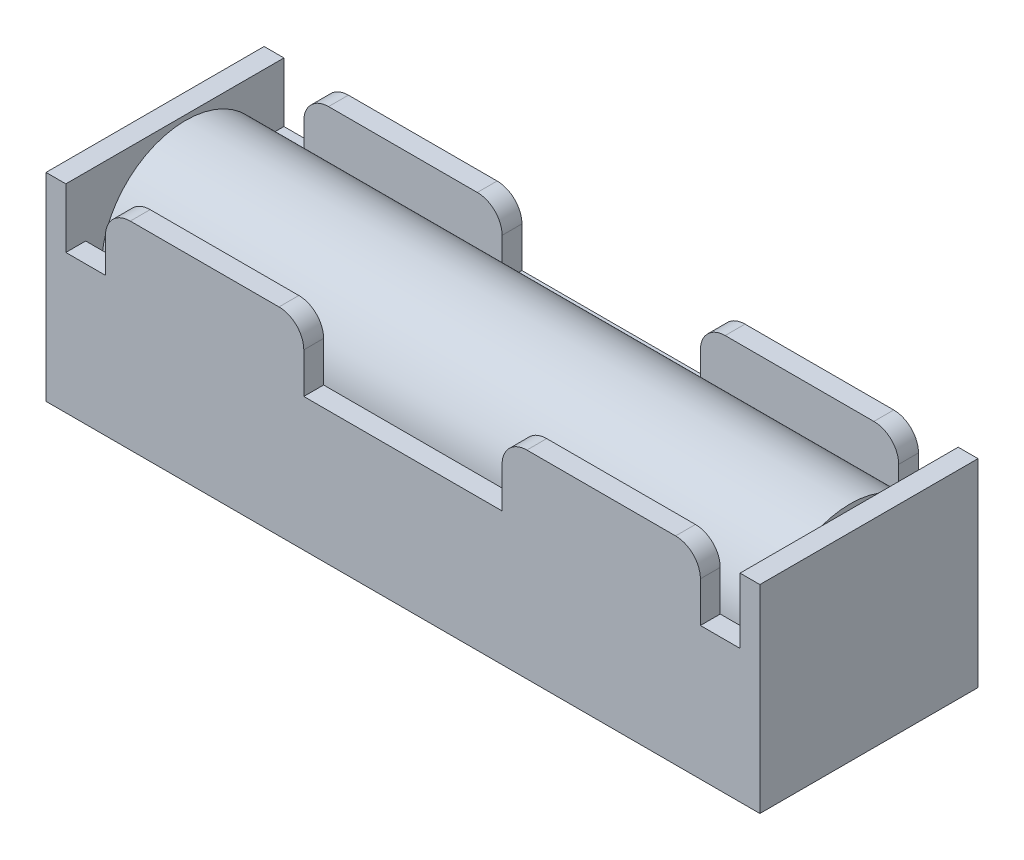
ISO-10303-21;
HEADER;
FILE_DESCRIPTION(('STEP AP214'),'2;1');
FILE_NAME('part.step','',(''),(''),'','','');
FILE_SCHEMA(('AUTOMOTIVE_DESIGN { 1 0 10303 214 1 1 1 1 }'));
ENDSEC;
DATA;
#1=APPLICATION_CONTEXT('core data for automotive mechanical design processes');
#2=APPLICATION_PROTOCOL_DEFINITION('international standard','automotive_design',2000,#1);
#3=PRODUCT_CONTEXT('',#1,'mechanical');
#4=PRODUCT('Part','Part','',(#3));
#5=PRODUCT_RELATED_PRODUCT_CATEGORY('part','',(#4));
#6=PRODUCT_DEFINITION_FORMATION('','',#4);
#7=PRODUCT_DEFINITION_CONTEXT('part definition',#1,'design');
#8=PRODUCT_DEFINITION('design','',#6,#7);
#9=PRODUCT_DEFINITION_SHAPE('','',#8);
#10=(LENGTH_UNIT() NAMED_UNIT(*) SI_UNIT(.MILLI.,.METRE.));
#11=(NAMED_UNIT(*) PLANE_ANGLE_UNIT() SI_UNIT($,.RADIAN.));
#12=(NAMED_UNIT(*) SI_UNIT($,.STERADIAN.) SOLID_ANGLE_UNIT());
#13=UNCERTAINTY_MEASURE_WITH_UNIT(LENGTH_MEASURE(1.E-05),#10,'distance_accuracy_value','');
#14=(GEOMETRIC_REPRESENTATION_CONTEXT(3) GLOBAL_UNCERTAINTY_ASSIGNED_CONTEXT((#13)) GLOBAL_UNIT_ASSIGNED_CONTEXT((#10,
#11,#12)) REPRESENTATION_CONTEXT('',''));
#15=CARTESIAN_POINT('',(0.,0.,0.));
#16=DIRECTION('',(0.,0.,1.));
#17=DIRECTION('',(1.,0.,0.));
#18=AXIS2_PLACEMENT_3D('',#15,#16,#17);
#19=CARTESIAN_POINT('',(21.6113360323887,2.,-21.7570850202429));
#20=DIRECTION('',(1.,0.,0.));
#21=DIRECTION('',(0.,0.,-1.));
#22=AXIS2_PLACEMENT_3D('',#19,#20,#21);
#23=PLANE('',#22);
#24=CARTESIAN_POINT('',(21.6113360323887,12.,-12.859898675805));
#25=DIRECTION('',(1.,0.,0.));
#26=DIRECTION('',(0.,0.,-1.));
#27=AXIS2_PLACEMENT_3D('',#24,#25,#26);
#28=CIRCLE('',#27,8.5);
#29=CARTESIAN_POINT('',(21.6113360323887,20.,-15.732179999074));
#30=VERTEX_POINT('',#29);
#31=CARTESIAN_POINT('',(21.6113360323887,20.,-9.98761735253599));
#32=VERTEX_POINT('',#31);
#33=EDGE_CURVE('E11',#30,#32,#28,.F.);
#34=ORIENTED_EDGE('',*,*,#33,.F.);
#35=DIRECTION('',(0.,0.,-1.));
#36=VECTOR('',#35,1.);
#37=CARTESIAN_POINT('',(21.6113360323887,20.,-21.7570850202429));
#38=LINE('',#37,#36);
#39=CARTESIAN_POINT('',(21.6113360323887,20.,-23.7570850202429));
#40=VERTEX_POINT('',#39);
#41=EDGE_CURVE('E278',#30,#40,#38,.T.);
#42=ORIENTED_EDGE('',*,*,#41,.T.);
#43=DIRECTION('',(0.,1.,0.));
#44=VECTOR('',#43,1.);
#45=CARTESIAN_POINT('',(21.6113360323887,20.,-23.7570850202429));
#46=LINE('',#45,#44);
#47=CARTESIAN_POINT('',(21.6113360323887,13.4242398730819,-23.7570850202429));
#48=VERTEX_POINT('',#47);
#49=EDGE_CURVE('E330',#48,#40,#46,.T.);
#50=ORIENTED_EDGE('',*,*,#49,.F.);
#51=DIRECTION('',(0.,0.,1.));
#52=VECTOR('',#51,1.);
#53=CARTESIAN_POINT('',(21.6113360323887,13.4242398730819,-31.7570850202429));
#54=LINE('',#53,#52);
#55=CARTESIAN_POINT('',(21.6113360323887,13.4242398730819,-21.7570850202429));
#56=VERTEX_POINT('',#55);
#57=EDGE_CURVE('E308',#48,#56,#54,.T.);
#58=ORIENTED_EDGE('',*,*,#57,.T.);
#59=DIRECTION('',(0.,1.,0.));
#60=VECTOR('',#59,1.);
#61=CARTESIAN_POINT('',(21.6113360323887,2.,-21.7570850202429));
#62=LINE('',#61,#60);
#63=CARTESIAN_POINT('',(21.6113360323887,2.,-21.7570850202429));
#64=VERTEX_POINT('',#63);
#65=EDGE_CURVE('E468',#64,#56,#62,.T.);
#66=ORIENTED_EDGE('',*,*,#65,.F.);
#67=DIRECTION('',(0.,0.,-1.));
#68=VECTOR('',#67,1.);
#69=CARTESIAN_POINT('',(21.6113360323887,2.,-21.7570850202429));
#70=LINE('',#69,#68);
#71=CARTESIAN_POINT('',(21.6113360323887,2.,-3.75708502024292));
#72=VERTEX_POINT('',#71);
#73=EDGE_CURVE('E451',#72,#64,#70,.T.);
#74=ORIENTED_EDGE('',*,*,#73,.F.);
#75=DIRECTION('',(0.,1.,0.));
#76=VECTOR('',#75,1.);
#77=CARTESIAN_POINT('',(21.6113360323887,2.,-3.75708502024292));
#78=LINE('',#77,#76);
#79=CARTESIAN_POINT('',(21.6113360323887,13.4242398730819,-3.75708502024292));
#80=VERTEX_POINT('',#79);
#81=EDGE_CURVE('E471',#72,#80,#78,.T.);
#82=ORIENTED_EDGE('',*,*,#81,.T.);
#83=CARTESIAN_POINT('',(21.6113360323887,13.4242398730819,-1.75708502024292));
#84=VERTEX_POINT('',#83);
#85=EDGE_CURVE('E309',#80,#84,#54,.T.);
#86=ORIENTED_EDGE('',*,*,#85,.T.);
#87=DIRECTION('',(0.,1.,0.));
#88=VECTOR('',#87,1.);
#89=CARTESIAN_POINT('',(21.6113360323887,0.,-1.75708502024292));
#90=LINE('',#89,#88);
#91=CARTESIAN_POINT('',(21.6113360323887,20.,-1.75708502024292));
#92=VERTEX_POINT('',#91);
#93=EDGE_CURVE('E272',#84,#92,#90,.T.);
#94=ORIENTED_EDGE('',*,*,#93,.T.);
#95=EDGE_CURVE('E269',#92,#32,#38,.T.);
#96=ORIENTED_EDGE('',*,*,#95,.T.);
#97=EDGE_LOOP('',(#34,#42,#50,#58,#66,#74,#82,#86,#94,#96));
#98=FACE_BOUND('',#97,.T.);
#99=ADVANCED_FACE('F34',(#98),#23,.F.);
#100=CARTESIAN_POINT('',(-48.3886639676113,20.,-1.75708502024292));
#101=DIRECTION('',(0.,0.,-1.));
#102=DIRECTION('',(-1.,0.,0.));
#103=AXIS2_PLACEMENT_3D('',#100,#101,#102);
#104=PLANE('',#103);
#105=CARTESIAN_POINT('',(15.1113360323887,17.4999999999999,-1.75708502024292));
#106=DIRECTION('',(0.,0.,1.));
#107=DIRECTION('',(1.,0.,0.));
#108=AXIS2_PLACEMENT_3D('',#105,#106,#107);
#109=CIRCLE('',#108,2.5);
#110=CARTESIAN_POINT('',(17.6113360323887,17.4999999999999,-1.75708502024292));
#111=VERTEX_POINT('',#110);
#112=CARTESIAN_POINT('',(15.1113360323887,20.,-1.75708502024292));
#113=VERTEX_POINT('',#112);
#114=EDGE_CURVE('E292',#111,#113,#109,.T.);
#115=ORIENTED_EDGE('',*,*,#114,.T.);
#116=DIRECTION('',(1.,0.,0.));
#117=VECTOR('',#116,1.);
#118=CARTESIAN_POINT('',(-48.3886639676113,20.,-1.75708502024292));
#119=LINE('',#118,#117);
#120=CARTESIAN_POINT('',(0.111336032388666,20.,-1.75708502024292));
#121=VERTEX_POINT('',#120);
#122=EDGE_CURVE('E546',#121,#113,#119,.T.);
#123=ORIENTED_EDGE('',*,*,#122,.F.);
#124=CARTESIAN_POINT('',(0.111336032388667,17.4999999999999,-1.75708502024292));
#125=DIRECTION('',(0.,0.,1.));
#126=DIRECTION('',(1.,0.,0.));
#127=AXIS2_PLACEMENT_3D('',#124,#125,#126);
#128=CIRCLE('',#127,2.5);
#129=CARTESIAN_POINT('',(-2.38866396761133,17.4999999999999,-1.75708502024292));
#130=VERTEX_POINT('',#129);
#131=EDGE_CURVE('E337',#121,#130,#128,.T.);
#132=ORIENTED_EDGE('',*,*,#131,.T.);
#133=DIRECTION('',(0.,1.,0.));
#134=VECTOR('',#133,1.);
#135=CARTESIAN_POINT('',(-2.38866396761133,0.,-1.75708502024292));
#136=LINE('',#135,#134);
#137=CARTESIAN_POINT('',(-2.38866396761133,13.4296487737832,-1.75708502024292));
#138=VERTEX_POINT('',#137);
#139=EDGE_CURVE('E349',#138,#130,#136,.T.);
#140=ORIENTED_EDGE('',*,*,#139,.F.);
#141=DIRECTION('',(1.,0.,0.));
#142=VECTOR('',#141,1.);
#143=CARTESIAN_POINT('',(0.,13.4296487737832,-1.75708502024292));
#144=LINE('',#143,#142);
#145=CARTESIAN_POINT('',(-22.3886639676113,13.4296487737832,-1.75708502024292));
#146=VERTEX_POINT('',#145);
#147=EDGE_CURVE('E346',#146,#138,#144,.T.);
#148=ORIENTED_EDGE('',*,*,#147,.F.);
#149=DIRECTION('',(0.,-1.,0.));
#150=VECTOR('',#149,1.);
#151=CARTESIAN_POINT('',(-22.3886639676113,0.,-1.75708502024292));
#152=LINE('',#151,#150);
#153=CARTESIAN_POINT('',(-22.3886639676113,17.5006897436102,-1.75708502024292));
#154=VERTEX_POINT('',#153);
#155=EDGE_CURVE('E343',#154,#146,#152,.T.);
#156=ORIENTED_EDGE('',*,*,#155,.F.);
#157=CARTESIAN_POINT('',(-24.8879742240011,17.5006897436102,-1.75708502024292));
#158=DIRECTION('',(0.,0.,1.));
#159=DIRECTION('',(1.,0.,0.));
#160=AXIS2_PLACEMENT_3D('',#157,#158,#159);
#161=CIRCLE('',#160,2.49931025638973);
#162=CARTESIAN_POINT('',(-24.8879742240011,20.,-1.75708502024292));
#163=VERTEX_POINT('',#162);
#164=EDGE_CURVE('E340',#154,#163,#161,.T.);
#165=ORIENTED_EDGE('',*,*,#164,.T.);
#166=CARTESIAN_POINT('',(-39.8879742240011,20.,-1.75708502024292));
#167=VERTEX_POINT('',#166);
#168=EDGE_CURVE('E485',#167,#163,#119,.T.);
#169=ORIENTED_EDGE('',*,*,#168,.F.);
#170=CARTESIAN_POINT('',(-39.8879742240011,17.4999999999999,-1.75708502024292));
#171=DIRECTION('',(0.,0.,1.));
#172=DIRECTION('',(1.,0.,0.));
#173=AXIS2_PLACEMENT_3D('',#170,#171,#172);
#174=CIRCLE('',#173,2.5);
#175=CARTESIAN_POINT('',(-42.3879742240011,17.4999999999999,-1.75708502024292));
#176=VERTEX_POINT('',#175);
#177=EDGE_CURVE('E398',#167,#176,#174,.T.);
#178=ORIENTED_EDGE('',*,*,#177,.T.);
#179=DIRECTION('',(0.,1.,0.));
#180=VECTOR('',#179,1.);
#181=CARTESIAN_POINT('',(-42.3879742240011,0.,-1.75708502024292));
#182=LINE('',#181,#180);
#183=CARTESIAN_POINT('',(-42.3879742240011,14.0070265503716,-1.75708502024292));
#184=VERTEX_POINT('',#183);
#185=EDGE_CURVE('E407',#184,#176,#182,.T.);
#186=ORIENTED_EDGE('',*,*,#185,.F.);
#187=DIRECTION('',(1.,0.,0.));
#188=VECTOR('',#187,1.);
#189=CARTESIAN_POINT('',(0.,14.0070265503716,-1.75708502024292));
#190=LINE('',#189,#188);
#191=CARTESIAN_POINT('',(-46.3886639676113,14.0070265503716,-1.75708502024292));
#192=VERTEX_POINT('',#191);
#193=EDGE_CURVE('E404',#192,#184,#190,.T.);
#194=ORIENTED_EDGE('',*,*,#193,.F.);
#195=DIRECTION('',(0.,-1.,0.));
#196=VECTOR('',#195,1.);
#197=CARTESIAN_POINT('',(-46.3886639676113,0.,-1.75708502024292));
#198=LINE('',#197,#196);
#199=CARTESIAN_POINT('',(-46.3886639676113,20.,-1.75708502024292));
#200=VERTEX_POINT('',#199);
#201=EDGE_CURVE('E401',#200,#192,#198,.T.);
#202=ORIENTED_EDGE('',*,*,#201,.F.);
#203=CARTESIAN_POINT('',(-48.3886639676113,20.,-1.75708502024292));
#204=VERTEX_POINT('',#203);
#205=EDGE_CURVE('E481',#204,#200,#119,.T.);
#206=ORIENTED_EDGE('',*,*,#205,.F.);
#207=DIRECTION('',(0.,-1.,0.));
#208=VECTOR('',#207,1.);
#209=CARTESIAN_POINT('',(-48.3886639676113,20.,-1.75708502024292));
#210=LINE('',#209,#208);
#211=CARTESIAN_POINT('',(-48.3886639676113,0.,-1.75708502024292));
#212=VERTEX_POINT('',#211);
#213=EDGE_CURVE('E507',#204,#212,#210,.T.);
#214=ORIENTED_EDGE('',*,*,#213,.T.);
#215=DIRECTION('',(1.,0.,0.));
#216=VECTOR('',#215,1.);
#217=CARTESIAN_POINT('',(-48.3886639676113,0.,-1.75708502024292));
#218=LINE('',#217,#216);
#219=CARTESIAN_POINT('',(23.6113360323887,0.,-1.75708502024292));
#220=VERTEX_POINT('',#219);
#221=EDGE_CURVE('E494',#212,#220,#218,.T.);
#222=ORIENTED_EDGE('',*,*,#221,.T.);
#223=DIRECTION('',(0.,-1.,0.));
#224=VECTOR('',#223,1.);
#225=CARTESIAN_POINT('',(23.6113360323887,20.,-1.75708502024292));
#226=LINE('',#225,#224);
#227=CARTESIAN_POINT('',(23.6113360323887,20.,-1.75708502024292));
#228=VERTEX_POINT('',#227);
#229=EDGE_CURVE('E504',#228,#220,#226,.T.);
#230=ORIENTED_EDGE('',*,*,#229,.F.);
#231=EDGE_CURVE('E479',#92,#228,#119,.T.);
#232=ORIENTED_EDGE('',*,*,#231,.F.);
#233=ORIENTED_EDGE('',*,*,#93,.F.);
#234=DIRECTION('',(1.,0.,0.));
#235=VECTOR('',#234,1.);
#236=CARTESIAN_POINT('',(0.,13.4242398730819,-1.75708502024292));
#237=LINE('',#236,#235);
#238=CARTESIAN_POINT('',(17.6113360323887,13.4242398730819,-1.75708502024292));
#239=VERTEX_POINT('',#238);
#240=EDGE_CURVE('E300',#239,#84,#237,.T.);
#241=ORIENTED_EDGE('',*,*,#240,.F.);
#242=DIRECTION('',(0.,-1.,0.));
#243=VECTOR('',#242,1.);
#244=CARTESIAN_POINT('',(17.6113360323887,0.,-1.75708502024292));
#245=LINE('',#244,#243);
#246=EDGE_CURVE('E297',#111,#239,#245,.T.);
#247=ORIENTED_EDGE('',*,*,#246,.F.);
#248=EDGE_LOOP('',(#115,#123,#132,#140,#148,#156,#165,#169,#178,#186,#194,#202,#206,#214,#222,
#230,#232,#233,#241,#247));
#249=FACE_BOUND('',#248,.T.);
#250=ADVANCED_FACE('F558',(#249),#104,.F.);
#251=CARTESIAN_POINT('',(-48.3886639676113,20.,-23.7570850202429));
#252=DIRECTION('',(0.,0.,1.));
#253=DIRECTION('',(1.,0.,0.));
#254=AXIS2_PLACEMENT_3D('',#251,#252,#253);
#255=PLANE('',#254);
#256=CARTESIAN_POINT('',(15.1113360323887,17.4999999999999,-23.7570850202429));
#257=DIRECTION('',(0.,0.,1.));
#258=DIRECTION('',(1.,0.,0.));
#259=AXIS2_PLACEMENT_3D('',#256,#257,#258);
#260=CIRCLE('',#259,2.5);
#261=CARTESIAN_POINT('',(17.6113360323887,17.4999999999999,-23.7570850202429));
#262=VERTEX_POINT('',#261);
#263=CARTESIAN_POINT('',(15.1113360323887,20.,-23.7570850202429));
#264=VERTEX_POINT('',#263);
#265=EDGE_CURVE('E335',#262,#264,#260,.T.);
#266=ORIENTED_EDGE('',*,*,#265,.F.);
#267=DIRECTION('',(0.,-1.,0.));
#268=VECTOR('',#267,1.);
#269=CARTESIAN_POINT('',(17.6113360323887,20.,-23.7570850202429));
#270=LINE('',#269,#268);
#271=CARTESIAN_POINT('',(17.6113360323887,13.4242398730819,-23.7570850202429));
#272=VERTEX_POINT('',#271);
#273=EDGE_CURVE('E327',#262,#272,#270,.T.);
#274=ORIENTED_EDGE('',*,*,#273,.T.);
#275=DIRECTION('',(1.,0.,0.));
#276=VECTOR('',#275,1.);
#277=CARTESIAN_POINT('',(-48.3886639676113,13.4242398730819,-23.7570850202429));
#278=LINE('',#277,#276);
#279=EDGE_CURVE('E321',#272,#48,#278,.T.);
#280=ORIENTED_EDGE('',*,*,#279,.T.);
#281=ORIENTED_EDGE('',*,*,#49,.T.);
#282=DIRECTION('',(-1.,0.,0.));
#283=VECTOR('',#282,1.);
#284=CARTESIAN_POINT('',(-48.3886639676113,20.,-23.7570850202429));
#285=LINE('',#284,#283);
#286=CARTESIAN_POINT('',(23.6113360323887,20.,-23.7570850202429));
#287=VERTEX_POINT('',#286);
#288=EDGE_CURVE('E488',#287,#40,#285,.T.);
#289=ORIENTED_EDGE('',*,*,#288,.F.);
#290=DIRECTION('',(0.,-1.,0.));
#291=VECTOR('',#290,1.);
#292=CARTESIAN_POINT('',(23.6113360323887,20.,-23.7570850202429));
#293=LINE('',#292,#291);
#294=CARTESIAN_POINT('',(23.6113360323887,0.,-23.7570850202429));
#295=VERTEX_POINT('',#294);
#296=EDGE_CURVE('E501',#287,#295,#293,.T.);
#297=ORIENTED_EDGE('',*,*,#296,.T.);
#298=DIRECTION('',(-1.,0.,0.));
#299=VECTOR('',#298,1.);
#300=CARTESIAN_POINT('',(-48.3886639676113,0.,-23.7570850202429));
#301=LINE('',#300,#299);
#302=CARTESIAN_POINT('',(-48.3886639676113,0.,-23.7570850202429));
#303=VERTEX_POINT('',#302);
#304=EDGE_CURVE('E480',#295,#303,#301,.T.);
#305=ORIENTED_EDGE('',*,*,#304,.T.);
#306=DIRECTION('',(0.,-1.,0.));
#307=VECTOR('',#306,1.);
#308=CARTESIAN_POINT('',(-48.3886639676113,20.,-23.7570850202429));
#309=LINE('',#308,#307);
#310=CARTESIAN_POINT('',(-48.3886639676113,20.,-23.7570850202429));
#311=VERTEX_POINT('',#310);
#312=EDGE_CURVE('E490',#311,#303,#309,.T.);
#313=ORIENTED_EDGE('',*,*,#312,.F.);
#314=CARTESIAN_POINT('',(-46.3886639676113,20.,-23.7570850202429));
#315=VERTEX_POINT('',#314);
#316=EDGE_CURVE('E487',#315,#311,#285,.T.);
#317=ORIENTED_EDGE('',*,*,#316,.F.);
#318=DIRECTION('',(0.,-1.,0.));
#319=VECTOR('',#318,1.);
#320=CARTESIAN_POINT('',(-46.3886639676113,20.,-23.7570850202429));
#321=LINE('',#320,#319);
#322=CARTESIAN_POINT('',(-46.3886639676113,14.0070265503716,-23.7570850202429));
#323=VERTEX_POINT('',#322);
#324=EDGE_CURVE('E423',#315,#323,#321,.T.);
#325=ORIENTED_EDGE('',*,*,#324,.T.);
#326=DIRECTION('',(1.,0.,0.));
#327=VECTOR('',#326,1.);
#328=CARTESIAN_POINT('',(-48.3886639676113,14.0070265503716,-23.7570850202429));
#329=LINE('',#328,#327);
#330=CARTESIAN_POINT('',(-42.3879742240011,14.0070265503716,-23.7570850202429));
#331=VERTEX_POINT('',#330);
#332=EDGE_CURVE('E429',#323,#331,#329,.T.);
#333=ORIENTED_EDGE('',*,*,#332,.T.);
#334=DIRECTION('',(0.,1.,0.));
#335=VECTOR('',#334,1.);
#336=CARTESIAN_POINT('',(-42.3879742240011,20.,-23.7570850202429));
#337=LINE('',#336,#335);
#338=CARTESIAN_POINT('',(-42.3879742240011,17.4999999999999,-23.7570850202429));
#339=VERTEX_POINT('',#338);
#340=EDGE_CURVE('E435',#331,#339,#337,.T.);
#341=ORIENTED_EDGE('',*,*,#340,.T.);
#342=CARTESIAN_POINT('',(-39.8879742240011,17.4999999999999,-23.7570850202429));
#343=DIRECTION('',(0.,0.,1.));
#344=DIRECTION('',(1.,0.,0.));
#345=AXIS2_PLACEMENT_3D('',#342,#343,#344);
#346=CIRCLE('',#345,2.5);
#347=CARTESIAN_POINT('',(-39.8879742240011,20.,-23.7570850202429));
#348=VERTEX_POINT('',#347);
#349=EDGE_CURVE('E441',#348,#339,#346,.T.);
#350=ORIENTED_EDGE('',*,*,#349,.F.);
#351=CARTESIAN_POINT('',(-24.8879742240011,20.,-23.7570850202429));
#352=VERTEX_POINT('',#351);
#353=EDGE_CURVE('E652',#352,#348,#285,.T.);
#354=ORIENTED_EDGE('',*,*,#353,.F.);
#355=CARTESIAN_POINT('',(-24.8879742240011,17.5006897436102,-23.7570850202429));
#356=DIRECTION('',(0.,0.,1.));
#357=DIRECTION('',(1.,0.,0.));
#358=AXIS2_PLACEMENT_3D('',#355,#356,#357);
#359=CIRCLE('',#358,2.49931025638973);
#360=CARTESIAN_POINT('',(-22.3886639676113,17.5006897436102,-23.7570850202429));
#361=VERTEX_POINT('',#360);
#362=EDGE_CURVE('E373',#361,#352,#359,.T.);
#363=ORIENTED_EDGE('',*,*,#362,.F.);
#364=DIRECTION('',(0.,-1.,0.));
#365=VECTOR('',#364,1.);
#366=CARTESIAN_POINT('',(-22.3886639676113,20.,-23.7570850202429));
#367=LINE('',#366,#365);
#368=CARTESIAN_POINT('',(-22.3886639676113,13.4296487737832,-23.7570850202429));
#369=VERTEX_POINT('',#368);
#370=EDGE_CURVE('E378',#361,#369,#367,.T.);
#371=ORIENTED_EDGE('',*,*,#370,.T.);
#372=DIRECTION('',(1.,0.,0.));
#373=VECTOR('',#372,1.);
#374=CARTESIAN_POINT('',(-48.3886639676113,13.4296487737832,-23.7570850202429));
#375=LINE('',#374,#373);
#376=CARTESIAN_POINT('',(-2.38866396761133,13.4296487737832,-23.7570850202429));
#377=VERTEX_POINT('',#376);
#378=EDGE_CURVE('E384',#369,#377,#375,.T.);
#379=ORIENTED_EDGE('',*,*,#378,.T.);
#380=DIRECTION('',(0.,1.,0.));
#381=VECTOR('',#380,1.);
#382=CARTESIAN_POINT('',(-2.38866396761133,20.,-23.7570850202429));
#383=LINE('',#382,#381);
#384=CARTESIAN_POINT('',(-2.38866396761133,17.4999999999999,-23.7570850202429));
#385=VERTEX_POINT('',#384);
#386=EDGE_CURVE('E390',#377,#385,#383,.T.);
#387=ORIENTED_EDGE('',*,*,#386,.T.);
#388=CARTESIAN_POINT('',(0.111336032388667,17.4999999999999,-23.7570850202429));
#389=DIRECTION('',(0.,0.,1.));
#390=DIRECTION('',(1.,0.,0.));
#391=AXIS2_PLACEMENT_3D('',#388,#389,#390);
#392=CIRCLE('',#391,2.5);
#393=CARTESIAN_POINT('',(0.111336032388666,20.,-23.7570850202429));
#394=VERTEX_POINT('',#393);
#395=EDGE_CURVE('E396',#394,#385,#392,.T.);
#396=ORIENTED_EDGE('',*,*,#395,.F.);
#397=EDGE_CURVE('E491',#264,#394,#285,.T.);
#398=ORIENTED_EDGE('',*,*,#397,.F.);
#399=EDGE_LOOP('',(#266,#274,#280,#281,#289,#297,#305,#313,#317,#325,#333,#341,#350,#354,#363,
#371,#379,#387,#396,#398));
#400=FACE_BOUND('',#399,.T.);
#401=ADVANCED_FACE('F571',(#400),#255,.F.);
#402=CARTESIAN_POINT('',(0.,20.,0.));
#403=DIRECTION('',(0.,1.,0.));
#404=DIRECTION('',(0.,0.,1.));
#405=AXIS2_PLACEMENT_3D('',#402,#403,#404);
#406=PLANE('',#405);
#407=DIRECTION('',(0.,0.,1.));
#408=VECTOR('',#407,1.);
#409=CARTESIAN_POINT('',(15.1113360323887,20.,-31.7570850202429));
#410=LINE('',#409,#408);
#411=CARTESIAN_POINT('',(15.1113360323887,20.,-3.75708502024292));
#412=VERTEX_POINT('',#411);
#413=EDGE_CURVE('E305',#412,#113,#410,.T.);
#414=ORIENTED_EDGE('',*,*,#413,.F.);
#415=DIRECTION('',(1.,0.,0.));
#416=VECTOR('',#415,1.);
#417=CARTESIAN_POINT('',(-46.3886639676113,20.,-3.75708502024292));
#418=LINE('',#417,#416);
#419=CARTESIAN_POINT('',(0.111336032388666,20.,-3.75708502024292));
#420=VERTEX_POINT('',#419);
#421=EDGE_CURVE('E459',#420,#412,#418,.T.);
#422=ORIENTED_EDGE('',*,*,#421,.F.);
#423=DIRECTION('',(0.,0.,1.));
#424=VECTOR('',#423,1.);
#425=CARTESIAN_POINT('',(0.111336032388666,20.,-31.7570850202429));
#426=LINE('',#425,#424);
#427=EDGE_CURVE('E352',#420,#121,#426,.T.);
#428=ORIENTED_EDGE('',*,*,#427,.T.);
#429=ORIENTED_EDGE('',*,*,#122,.T.);
#430=EDGE_LOOP('',(#414,#422,#428,#429));
#431=FACE_BOUND('',#430,.T.);
#432=ADVANCED_FACE('F544',(#431),#406,.T.);
#433=CARTESIAN_POINT('',(15.1113360323887,20.,-21.7570850202429));
#434=VERTEX_POINT('',#433);
#435=EDGE_CURVE('E307',#264,#434,#410,.T.);
#436=ORIENTED_EDGE('',*,*,#435,.F.);
#437=ORIENTED_EDGE('',*,*,#397,.T.);
#438=CARTESIAN_POINT('',(0.111336032388666,20.,-21.7570850202429));
#439=VERTEX_POINT('',#438);
#440=EDGE_CURVE('E368',#394,#439,#426,.T.);
#441=ORIENTED_EDGE('',*,*,#440,.T.);
#442=DIRECTION('',(-1.,0.,0.));
#443=VECTOR('',#442,1.);
#444=CARTESIAN_POINT('',(-46.3886639676113,20.,-21.7570850202429));
#445=LINE('',#444,#443);
#446=EDGE_CURVE('E448',#434,#439,#445,.T.);
#447=ORIENTED_EDGE('',*,*,#446,.F.);
#448=EDGE_LOOP('',(#436,#437,#441,#447));
#449=FACE_BOUND('',#448,.T.);
#450=ADVANCED_FACE('F663',(#449),#406,.T.);
#451=CARTESIAN_POINT('',(-46.3886639676113,2.,-21.7570850202429));
#452=DIRECTION('',(0.,0.,-1.));
#453=DIRECTION('',(-1.,0.,0.));
#454=AXIS2_PLACEMENT_3D('',#451,#452,#453);
#455=PLANE('',#454);
#456=CARTESIAN_POINT('',(15.1113360323887,17.4999999999999,-21.7570850202429));
#457=DIRECTION('',(0.,0.,-1.));
#458=DIRECTION('',(-1.,0.,0.));
#459=AXIS2_PLACEMENT_3D('',#456,#457,#458);
#460=CIRCLE('',#459,2.5);
#461=CARTESIAN_POINT('',(17.6113360323887,17.4999999999999,-21.7570850202429));
#462=VERTEX_POINT('',#461);
#463=EDGE_CURVE('E333',#434,#462,#460,.T.);
#464=ORIENTED_EDGE('',*,*,#463,.F.);
#465=ORIENTED_EDGE('',*,*,#446,.T.);
#466=CARTESIAN_POINT('',(0.111336032388667,17.4999999999999,-21.7570850202429));
#467=DIRECTION('',(0.,0.,-1.));
#468=DIRECTION('',(-1.,0.,0.));
#469=AXIS2_PLACEMENT_3D('',#466,#467,#468);
#470=CIRCLE('',#469,2.5);
#471=CARTESIAN_POINT('',(-2.38866396761133,17.4999999999999,-21.7570850202429));
#472=VERTEX_POINT('',#471);
#473=EDGE_CURVE('E393',#472,#439,#470,.T.);
#474=ORIENTED_EDGE('',*,*,#473,.F.);
#475=DIRECTION('',(0.,-1.,0.));
#476=VECTOR('',#475,1.);
#477=CARTESIAN_POINT('',(-2.38866396761133,2.,-21.7570850202429));
#478=LINE('',#477,#476);
#479=CARTESIAN_POINT('',(-2.38866396761133,13.4296487737832,-21.7570850202429));
#480=VERTEX_POINT('',#479);
#481=EDGE_CURVE('E387',#472,#480,#478,.T.);
#482=ORIENTED_EDGE('',*,*,#481,.T.);
#483=DIRECTION('',(-1.,0.,0.));
#484=VECTOR('',#483,1.);
#485=CARTESIAN_POINT('',(-46.3886639676113,13.4296487737832,-21.7570850202429));
#486=LINE('',#485,#484);
#487=CARTESIAN_POINT('',(-22.3886639676113,13.4296487737832,-21.7570850202429));
#488=VERTEX_POINT('',#487);
#489=EDGE_CURVE('E381',#480,#488,#486,.T.);
#490=ORIENTED_EDGE('',*,*,#489,.T.);
#491=DIRECTION('',(0.,1.,0.));
#492=VECTOR('',#491,1.);
#493=CARTESIAN_POINT('',(-22.3886639676113,2.00000000000002,-21.7570850202429));
#494=LINE('',#493,#492);
#495=CARTESIAN_POINT('',(-22.3886639676113,17.5006897436102,-21.7570850202429));
#496=VERTEX_POINT('',#495);
#497=EDGE_CURVE('E375',#488,#496,#494,.T.);
#498=ORIENTED_EDGE('',*,*,#497,.T.);
#499=CARTESIAN_POINT('',(-24.8879742240011,17.5006897436102,-21.7570850202429));
#500=DIRECTION('',(0.,0.,-1.));
#501=DIRECTION('',(-1.,0.,0.));
#502=AXIS2_PLACEMENT_3D('',#499,#500,#501);
#503=CIRCLE('',#502,2.49931025638973);
#504=CARTESIAN_POINT('',(-24.8879742240011,20.,-21.7570850202429));
#505=VERTEX_POINT('',#504);
#506=EDGE_CURVE('E371',#505,#496,#503,.T.);
#507=ORIENTED_EDGE('',*,*,#506,.F.);
#508=CARTESIAN_POINT('',(-39.8879742240011,20.,-21.7570850202429));
#509=VERTEX_POINT('',#508);
#510=EDGE_CURVE('E275',#505,#509,#445,.T.);
#511=ORIENTED_EDGE('',*,*,#510,.T.);
#512=CARTESIAN_POINT('',(-39.8879742240011,17.4999999999999,-21.7570850202429));
#513=DIRECTION('',(0.,0.,-1.));
#514=DIRECTION('',(-1.,0.,0.));
#515=AXIS2_PLACEMENT_3D('',#512,#513,#514);
#516=CIRCLE('',#515,2.5);
#517=CARTESIAN_POINT('',(-42.3879742240011,17.4999999999999,-21.7570850202429));
#518=VERTEX_POINT('',#517);
#519=EDGE_CURVE('E438',#518,#509,#516,.T.);
#520=ORIENTED_EDGE('',*,*,#519,.F.);
#521=DIRECTION('',(0.,-1.,0.));
#522=VECTOR('',#521,1.);
#523=CARTESIAN_POINT('',(-42.3879742240011,2.,-21.7570850202429));
#524=LINE('',#523,#522);
#525=CARTESIAN_POINT('',(-42.3879742240011,14.0070265503716,-21.7570850202429));
#526=VERTEX_POINT('',#525);
#527=EDGE_CURVE('E432',#518,#526,#524,.T.);
#528=ORIENTED_EDGE('',*,*,#527,.T.);
#529=DIRECTION('',(-1.,0.,0.));
#530=VECTOR('',#529,1.);
#531=CARTESIAN_POINT('',(-46.3886639676113,14.0070265503716,-21.7570850202429));
#532=LINE('',#531,#530);
#533=CARTESIAN_POINT('',(-46.3886639676113,14.0070265503716,-21.7570850202429));
#534=VERTEX_POINT('',#533);
#535=EDGE_CURVE('E426',#526,#534,#532,.T.);
#536=ORIENTED_EDGE('',*,*,#535,.T.);
#537=DIRECTION('',(0.,1.,0.));
#538=VECTOR('',#537,1.);
#539=CARTESIAN_POINT('',(-46.3886639676113,2.,-21.7570850202429));
#540=LINE('',#539,#538);
#541=CARTESIAN_POINT('',(-46.3886639676113,2.,-21.7570850202429));
#542=VERTEX_POINT('',#541);
#543=EDGE_CURVE('E464',#542,#534,#540,.T.);
#544=ORIENTED_EDGE('',*,*,#543,.F.);
#545=DIRECTION('',(-1.,0.,0.));
#546=VECTOR('',#545,1.);
#547=CARTESIAN_POINT('',(-46.3886639676113,2.,-21.7570850202429));
#548=LINE('',#547,#546);
#549=EDGE_CURVE('E454',#64,#542,#548,.T.);
#550=ORIENTED_EDGE('',*,*,#549,.F.);
#551=ORIENTED_EDGE('',*,*,#65,.T.);
#552=DIRECTION('',(-1.,0.,0.));
#553=VECTOR('',#552,1.);
#554=CARTESIAN_POINT('',(-46.3886639676113,13.4242398730819,-21.7570850202429));
#555=LINE('',#554,#553);
#556=CARTESIAN_POINT('',(17.6113360323887,13.4242398730819,-21.7570850202429));
#557=VERTEX_POINT('',#556);
#558=EDGE_CURVE('E318',#56,#557,#555,.T.);
#559=ORIENTED_EDGE('',*,*,#558,.T.);
#560=DIRECTION('',(0.,1.,0.));
#561=VECTOR('',#560,1.);
#562=CARTESIAN_POINT('',(17.6113360323887,2.,-21.7570850202429));
#563=LINE('',#562,#561);
#564=EDGE_CURVE('E324',#557,#462,#563,.T.);
#565=ORIENTED_EDGE('',*,*,#564,.T.);
#566=EDGE_LOOP('',(#464,#465,#474,#482,#490,#498,#507,#511,#520,#528,#536,#544,#550,#551,#559,#565));
#567=FACE_BOUND('',#566,.T.);
#568=ADVANCED_FACE('F580',(#567),#455,.F.);
#569=CARTESIAN_POINT('',(-46.3886639676113,2.,-3.75708502024292));
#570=DIRECTION('',(0.,0.,1.));
#571=DIRECTION('',(1.,0.,0.));
#572=AXIS2_PLACEMENT_3D('',#569,#570,#571);
#573=PLANE('',#572);
#574=CARTESIAN_POINT('',(15.1113360323887,17.4999999999999,-3.75708502024292));
#575=DIRECTION('',(0.,0.,1.));
#576=DIRECTION('',(1.,0.,0.));
#577=AXIS2_PLACEMENT_3D('',#574,#575,#576);
#578=CIRCLE('',#577,2.5);
#579=CARTESIAN_POINT('',(17.6113360323887,17.4999999999999,-3.75708502024292));
#580=VERTEX_POINT('',#579);
#581=EDGE_CURVE('E42',#580,#412,#578,.T.);
#582=ORIENTED_EDGE('',*,*,#581,.F.);
#583=DIRECTION('',(0.,-1.,0.));
#584=VECTOR('',#583,1.);
#585=CARTESIAN_POINT('',(17.6113360323887,2.,-3.75708502024292));
#586=LINE('',#585,#584);
#587=CARTESIAN_POINT('',(17.6113360323887,13.4242398730819,-3.75708502024292));
#588=VERTEX_POINT('',#587);
#589=EDGE_CURVE('E531',#580,#588,#586,.T.);
#590=ORIENTED_EDGE('',*,*,#589,.T.);
#591=DIRECTION('',(1.,0.,0.));
#592=VECTOR('',#591,1.);
#593=CARTESIAN_POINT('',(-46.3886639676113,13.4242398730819,-3.75708502024292));
#594=LINE('',#593,#592);
#595=EDGE_CURVE('E315',#588,#80,#594,.T.);
#596=ORIENTED_EDGE('',*,*,#595,.T.);
#597=ORIENTED_EDGE('',*,*,#81,.F.);
#598=DIRECTION('',(1.,0.,0.));
#599=VECTOR('',#598,1.);
#600=CARTESIAN_POINT('',(-46.3886639676113,2.,-3.75708502024292));
#601=LINE('',#600,#599);
#602=CARTESIAN_POINT('',(-46.3886639676113,2.,-3.75708502024292));
#603=VERTEX_POINT('',#602);
#604=EDGE_CURVE('E447',#603,#72,#601,.T.);
#605=ORIENTED_EDGE('',*,*,#604,.F.);
#606=DIRECTION('',(0.,1.,0.));
#607=VECTOR('',#606,1.);
#608=CARTESIAN_POINT('',(-46.3886639676113,2.,-3.75708502024292));
#609=LINE('',#608,#607);
#610=CARTESIAN_POINT('',(-46.3886639676113,14.0070265503716,-3.75708502024292));
#611=VERTEX_POINT('',#610);
#612=EDGE_CURVE('E457',#603,#611,#609,.T.);
#613=ORIENTED_EDGE('',*,*,#612,.T.);
#614=DIRECTION('',(1.,0.,0.));
#615=VECTOR('',#614,1.);
#616=CARTESIAN_POINT('',(-46.3886639676113,14.0070265503716,-3.75708502024292));
#617=LINE('',#616,#615);
#618=CARTESIAN_POINT('',(-42.3879742240011,14.0070265503716,-3.75708502024292));
#619=VERTEX_POINT('',#618);
#620=EDGE_CURVE('E510',#611,#619,#617,.T.);
#621=ORIENTED_EDGE('',*,*,#620,.T.);
#622=DIRECTION('',(0.,1.,0.));
#623=VECTOR('',#622,1.);
#624=CARTESIAN_POINT('',(-42.3879742240011,2.,-3.75708502024292));
#625=LINE('',#624,#623);
#626=CARTESIAN_POINT('',(-42.3879742240011,17.4999999999999,-3.75708502024292));
#627=VERTEX_POINT('',#626);
#628=EDGE_CURVE('E513',#619,#627,#625,.T.);
#629=ORIENTED_EDGE('',*,*,#628,.T.);
#630=CARTESIAN_POINT('',(-39.8879742240011,17.4999999999999,-3.75708502024292));
#631=DIRECTION('',(0.,0.,1.));
#632=DIRECTION('',(1.,0.,0.));
#633=AXIS2_PLACEMENT_3D('',#630,#631,#632);
#634=CIRCLE('',#633,2.5);
#635=CARTESIAN_POINT('',(-39.8879742240011,20.,-3.75708502024292));
#636=VERTEX_POINT('',#635);
#637=EDGE_CURVE('E516',#636,#627,#634,.T.);
#638=ORIENTED_EDGE('',*,*,#637,.F.);
#639=CARTESIAN_POINT('',(-24.8879742240011,20.,-3.75708502024292));
#640=VERTEX_POINT('',#639);
#641=EDGE_CURVE('E460',#636,#640,#418,.T.);
#642=ORIENTED_EDGE('',*,*,#641,.T.);
#643=CARTESIAN_POINT('',(-24.8879742240011,17.5006897436102,-3.75708502024292));
#644=DIRECTION('',(0.,0.,1.));
#645=DIRECTION('',(1.,0.,0.));
#646=AXIS2_PLACEMENT_3D('',#643,#644,#645);
#647=CIRCLE('',#646,2.49931025638973);
#648=CARTESIAN_POINT('',(-22.3886639676113,17.5006897436102,-3.75708502024292));
#649=VERTEX_POINT('',#648);
#650=EDGE_CURVE('E518',#649,#640,#647,.T.);
#651=ORIENTED_EDGE('',*,*,#650,.F.);
#652=DIRECTION('',(0.,-1.,0.));
#653=VECTOR('',#652,1.);
#654=CARTESIAN_POINT('',(-22.3886639676113,2.00000000000002,-3.75708502024292));
#655=LINE('',#654,#653);
#656=CARTESIAN_POINT('',(-22.3886639676113,13.4296487737832,-3.75708502024292));
#657=VERTEX_POINT('',#656);
#658=EDGE_CURVE('E520',#649,#657,#655,.T.);
#659=ORIENTED_EDGE('',*,*,#658,.T.);
#660=DIRECTION('',(1.,0.,0.));
#661=VECTOR('',#660,1.);
#662=CARTESIAN_POINT('',(-46.3886639676113,13.4296487737832,-3.75708502024292));
#663=LINE('',#662,#661);
#664=CARTESIAN_POINT('',(-2.38866396761133,13.4296487737832,-3.75708502024292));
#665=VERTEX_POINT('',#664);
#666=EDGE_CURVE('E523',#657,#665,#663,.T.);
#667=ORIENTED_EDGE('',*,*,#666,.T.);
#668=DIRECTION('',(0.,1.,0.));
#669=VECTOR('',#668,1.);
#670=CARTESIAN_POINT('',(-2.38866396761133,2.,-3.75708502024292));
#671=LINE('',#670,#669);
#672=CARTESIAN_POINT('',(-2.38866396761133,17.4999999999999,-3.75708502024292));
#673=VERTEX_POINT('',#672);
#674=EDGE_CURVE('E526',#665,#673,#671,.T.);
#675=ORIENTED_EDGE('',*,*,#674,.T.);
#676=CARTESIAN_POINT('',(0.111336032388667,17.4999999999999,-3.75708502024292));
#677=DIRECTION('',(0.,0.,1.));
#678=DIRECTION('',(1.,0.,0.));
#679=AXIS2_PLACEMENT_3D('',#676,#677,#678);
#680=CIRCLE('',#679,2.5);
#681=EDGE_CURVE('E529',#420,#673,#680,.T.);
#682=ORIENTED_EDGE('',*,*,#681,.F.);
#683=ORIENTED_EDGE('',*,*,#421,.T.);
#684=EDGE_LOOP('',(#582,#590,#596,#597,#605,#613,#621,#629,#638,#642,#651,#659,#667,#675,#682,#683));
#685=FACE_BOUND('',#684,.T.);
#686=ADVANCED_FACE('F548',(#685),#573,.F.);
#687=ORIENTED_EDGE('',*,*,#95,.F.);
#688=ORIENTED_EDGE('',*,*,#231,.T.);
#689=DIRECTION('',(0.,0.,-1.));
#690=VECTOR('',#689,1.);
#691=CARTESIAN_POINT('',(23.6113360323887,20.,-23.7570850202429));
#692=LINE('',#691,#690);
#693=EDGE_CURVE('E484',#228,#287,#692,.T.);
#694=ORIENTED_EDGE('',*,*,#693,.T.);
#695=ORIENTED_EDGE('',*,*,#288,.T.);
#696=ORIENTED_EDGE('',*,*,#41,.F.);
#697=EDGE_CURVE('E276',#32,#30,#38,.T.);
#698=ORIENTED_EDGE('',*,*,#697,.F.);
#699=EDGE_LOOP('',(#687,#688,#694,#695,#696,#698));
#700=FACE_BOUND('',#699,.T.);
#701=ADVANCED_FACE('F280',(#700),#406,.T.);
#702=DIRECTION('',(0.,0.,1.));
#703=VECTOR('',#702,1.);
#704=CARTESIAN_POINT('',(-24.8879742240011,20.,-31.7570850202429));
#705=LINE('',#704,#703);
#706=EDGE_CURVE('E365',#352,#505,#705,.T.);
#707=ORIENTED_EDGE('',*,*,#706,.F.);
#708=ORIENTED_EDGE('',*,*,#353,.T.);
#709=DIRECTION('',(0.,0.,1.));
#710=VECTOR('',#709,1.);
#711=CARTESIAN_POINT('',(-39.8879742240011,20.,-31.7570850202429));
#712=LINE('',#711,#710);
#713=EDGE_CURVE('E420',#348,#509,#712,.T.);
#714=ORIENTED_EDGE('',*,*,#713,.T.);
#715=ORIENTED_EDGE('',*,*,#510,.F.);
#716=EDGE_LOOP('',(#707,#708,#714,#715));
#717=FACE_BOUND('',#716,.T.);
#718=ADVANCED_FACE('F642',(#717),#406,.T.);
#719=EDGE_CURVE('E366',#640,#163,#705,.T.);
#720=ORIENTED_EDGE('',*,*,#719,.F.);
#721=ORIENTED_EDGE('',*,*,#641,.F.);
#722=EDGE_CURVE('E410',#636,#167,#712,.T.);
#723=ORIENTED_EDGE('',*,*,#722,.T.);
#724=ORIENTED_EDGE('',*,*,#168,.T.);
#725=EDGE_LOOP('',(#720,#721,#723,#724));
#726=FACE_BOUND('',#725,.T.);
#727=ADVANCED_FACE('F628',(#726),#406,.T.);
#728=CARTESIAN_POINT('',(-48.3886639676113,20.,-23.7570850202429));
#729=DIRECTION('',(1.,0.,0.));
#730=DIRECTION('',(0.,0.,-1.));
#731=AXIS2_PLACEMENT_3D('',#728,#729,#730);
#732=PLANE('',#731);
#733=DIRECTION('',(0.,0.,1.));
#734=VECTOR('',#733,1.);
#735=CARTESIAN_POINT('',(-48.3886639676113,0.,-23.7570850202429));
#736=LINE('',#735,#734);
#737=EDGE_CURVE('E467',#303,#212,#736,.T.);
#738=ORIENTED_EDGE('',*,*,#737,.T.);
#739=ORIENTED_EDGE('',*,*,#213,.F.);
#740=DIRECTION('',(0.,0.,1.));
#741=VECTOR('',#740,1.);
#742=CARTESIAN_POINT('',(-48.3886639676113,20.,-23.7570850202429));
#743=LINE('',#742,#741);
#744=EDGE_CURVE('E476',#311,#204,#743,.T.);
#745=ORIENTED_EDGE('',*,*,#744,.F.);
#746=ORIENTED_EDGE('',*,*,#312,.T.);
#747=EDGE_LOOP('',(#738,#739,#745,#746));
#748=FACE_BOUND('',#747,.T.);
#749=ADVANCED_FACE('F36',(#748),#732,.F.);
#750=CARTESIAN_POINT('',(23.6113360323887,20.,-23.7570850202429));
#751=DIRECTION('',(-1.,0.,0.));
#752=DIRECTION('',(0.,0.,1.));
#753=AXIS2_PLACEMENT_3D('',#750,#751,#752);
#754=PLANE('',#753);
#755=DIRECTION('',(0.,0.,-1.));
#756=VECTOR('',#755,1.);
#757=CARTESIAN_POINT('',(23.6113360323887,0.,-23.7570850202429));
#758=LINE('',#757,#756);
#759=EDGE_CURVE('E496',#220,#295,#758,.T.);
#760=ORIENTED_EDGE('',*,*,#759,.T.);
#761=ORIENTED_EDGE('',*,*,#296,.F.);
#762=ORIENTED_EDGE('',*,*,#693,.F.);
#763=ORIENTED_EDGE('',*,*,#229,.T.);
#764=EDGE_LOOP('',(#760,#761,#762,#763));
#765=FACE_BOUND('',#764,.T.);
#766=ADVANCED_FACE('F566',(#765),#754,.F.);
#767=DIRECTION('',(0.,0.,1.));
#768=VECTOR('',#767,1.);
#769=CARTESIAN_POINT('',(-46.3886639676113,20.,-21.7570850202429));
#770=LINE('',#769,#768);
#771=EDGE_CURVE('E443',#315,#200,#770,.T.);
#772=ORIENTED_EDGE('',*,*,#771,.F.);
#773=ORIENTED_EDGE('',*,*,#316,.T.);
#774=ORIENTED_EDGE('',*,*,#744,.T.);
#775=ORIENTED_EDGE('',*,*,#205,.T.);
#776=EDGE_LOOP('',(#772,#773,#774,#775));
#777=FACE_BOUND('',#776,.T.);
#778=ADVANCED_FACE('F624',(#777),#406,.T.);
#779=CARTESIAN_POINT('',(0.,0.,0.));
#780=DIRECTION('',(0.,1.,0.));
#781=DIRECTION('',(0.,0.,1.));
#782=AXIS2_PLACEMENT_3D('',#779,#780,#781);
#783=PLANE('',#782);
#784=ORIENTED_EDGE('',*,*,#737,.F.);
#785=ORIENTED_EDGE('',*,*,#304,.F.);
#786=ORIENTED_EDGE('',*,*,#759,.F.);
#787=ORIENTED_EDGE('',*,*,#221,.F.);
#788=EDGE_LOOP('',(#784,#785,#786,#787));
#789=FACE_BOUND('',#788,.T.);
#790=ADVANCED_FACE('F622',(#789),#783,.F.);
#791=CARTESIAN_POINT('',(-46.3886639676113,2.,-21.7570850202429));
#792=DIRECTION('',(-1.,0.,0.));
#793=DIRECTION('',(0.,0.,1.));
#794=AXIS2_PLACEMENT_3D('',#791,#792,#793);
#795=PLANE('',#794);
#796=ORIENTED_EDGE('',*,*,#543,.T.);
#797=DIRECTION('',(0.,0.,1.));
#798=VECTOR('',#797,1.);
#799=CARTESIAN_POINT('',(-46.3886639676113,14.0070265503716,-31.7570850202429));
#800=LINE('',#799,#798);
#801=EDGE_CURVE('E417',#323,#534,#800,.T.);
#802=ORIENTED_EDGE('',*,*,#801,.F.);
#803=ORIENTED_EDGE('',*,*,#324,.F.);
#804=ORIENTED_EDGE('',*,*,#771,.T.);
#805=ORIENTED_EDGE('',*,*,#201,.T.);
#806=EDGE_CURVE('E418',#611,#192,#800,.T.);
#807=ORIENTED_EDGE('',*,*,#806,.F.);
#808=ORIENTED_EDGE('',*,*,#612,.F.);
#809=DIRECTION('',(0.,0.,1.));
#810=VECTOR('',#809,1.);
#811=CARTESIAN_POINT('',(-46.3886639676113,2.,-21.7570850202429));
#812=LINE('',#811,#810);
#813=EDGE_CURVE('E444',#542,#603,#812,.T.);
#814=ORIENTED_EDGE('',*,*,#813,.F.);
#815=EDGE_LOOP('',(#796,#802,#803,#804,#805,#807,#808,#814));
#816=FACE_BOUND('',#815,.T.);
#817=ADVANCED_FACE('F619',(#816),#795,.F.);
#818=CARTESIAN_POINT('',(0.,2.,0.));
#819=DIRECTION('',(0.,1.,0.));
#820=DIRECTION('',(0.,0.,1.));
#821=AXIS2_PLACEMENT_3D('',#818,#819,#820);
#822=PLANE('',#821);
#823=ORIENTED_EDGE('',*,*,#813,.T.);
#824=ORIENTED_EDGE('',*,*,#604,.T.);
#825=ORIENTED_EDGE('',*,*,#73,.T.);
#826=ORIENTED_EDGE('',*,*,#549,.T.);
#827=EDGE_LOOP('',(#823,#824,#825,#826));
#828=FACE_BOUND('',#827,.T.);
#829=ADVANCED_FACE('F584',(#828),#822,.T.);
#830=CARTESIAN_POINT('',(0.,14.0070265503716,-31.7570850202429));
#831=DIRECTION('',(0.,-1.,0.));
#832=DIRECTION('',(0.,0.,-1.));
#833=AXIS2_PLACEMENT_3D('',#830,#831,#832);
#834=PLANE('',#833);
#835=ORIENTED_EDGE('',*,*,#806,.T.);
#836=ORIENTED_EDGE('',*,*,#193,.T.);
#837=DIRECTION('',(0.,0.,1.));
#838=VECTOR('',#837,1.);
#839=CARTESIAN_POINT('',(-42.3879742240011,14.0070265503716,-31.7570850202429));
#840=LINE('',#839,#838);
#841=EDGE_CURVE('E415',#619,#184,#840,.T.);
#842=ORIENTED_EDGE('',*,*,#841,.F.);
#843=ORIENTED_EDGE('',*,*,#620,.F.);
#844=EDGE_LOOP('',(#835,#836,#842,#843));
#845=FACE_BOUND('',#844,.T.);
#846=ADVANCED_FACE('F707',(#845),#834,.F.);
#847=CARTESIAN_POINT('',(-42.3879742240011,0.,-31.7570850202429));
#848=DIRECTION('',(1.,0.,0.));
#849=DIRECTION('',(0.,0.,-1.));
#850=AXIS2_PLACEMENT_3D('',#847,#848,#849);
#851=PLANE('',#850);
#852=ORIENTED_EDGE('',*,*,#841,.T.);
#853=ORIENTED_EDGE('',*,*,#185,.T.);
#854=DIRECTION('',(0.,0.,1.));
#855=VECTOR('',#854,1.);
#856=CARTESIAN_POINT('',(-42.3879742240011,17.4999999999999,-31.7570850202429));
#857=LINE('',#856,#855);
#858=EDGE_CURVE('E411',#627,#176,#857,.T.);
#859=ORIENTED_EDGE('',*,*,#858,.F.);
#860=ORIENTED_EDGE('',*,*,#628,.F.);
#861=EDGE_LOOP('',(#852,#853,#859,#860));
#862=FACE_BOUND('',#861,.T.);
#863=ADVANCED_FACE('F703',(#862),#851,.F.);
#864=CARTESIAN_POINT('',(-39.8879742240011,17.4999999999999,-31.7570850202429));
#865=DIRECTION('',(0.,0.,1.));
#866=DIRECTION('',(1.,0.,0.));
#867=AXIS2_PLACEMENT_3D('',#864,#865,#866);
#868=CYLINDRICAL_SURFACE('',#867,2.5);
#869=ORIENTED_EDGE('',*,*,#637,.T.);
#870=ORIENTED_EDGE('',*,*,#858,.T.);
#871=ORIENTED_EDGE('',*,*,#177,.F.);
#872=ORIENTED_EDGE('',*,*,#722,.F.);
#873=EDGE_LOOP('',(#869,#870,#871,#872));
#874=FACE_BOUND('',#873,.T.);
#875=ADVANCED_FACE('F709',(#874),#868,.T.);
#876=ORIENTED_EDGE('',*,*,#349,.T.);
#877=EDGE_CURVE('E413',#339,#518,#857,.T.);
#878=ORIENTED_EDGE('',*,*,#877,.T.);
#879=ORIENTED_EDGE('',*,*,#519,.T.);
#880=ORIENTED_EDGE('',*,*,#713,.F.);
#881=EDGE_LOOP('',(#876,#878,#879,#880));
#882=FACE_BOUND('',#881,.T.);
#883=ADVANCED_FACE('F701',(#882),#868,.T.);
#884=EDGE_CURVE('E414',#331,#526,#840,.T.);
#885=ORIENTED_EDGE('',*,*,#884,.T.);
#886=ORIENTED_EDGE('',*,*,#527,.F.);
#887=ORIENTED_EDGE('',*,*,#877,.F.);
#888=ORIENTED_EDGE('',*,*,#340,.F.);
#889=EDGE_LOOP('',(#885,#886,#887,#888));
#890=FACE_BOUND('',#889,.T.);
#891=ADVANCED_FACE('F697',(#890),#851,.F.);
#892=ORIENTED_EDGE('',*,*,#801,.T.);
#893=ORIENTED_EDGE('',*,*,#535,.F.);
#894=ORIENTED_EDGE('',*,*,#884,.F.);
#895=ORIENTED_EDGE('',*,*,#332,.F.);
#896=EDGE_LOOP('',(#892,#893,#894,#895));
#897=FACE_BOUND('',#896,.T.);
#898=ADVANCED_FACE('F700',(#897),#834,.F.);
#899=CARTESIAN_POINT('',(-24.8879742240011,17.5006897436102,-31.7570850202429));
#900=DIRECTION('',(0.,0.,1.));
#901=DIRECTION('',(1.,0.,0.));
#902=AXIS2_PLACEMENT_3D('',#899,#900,#901);
#903=CYLINDRICAL_SURFACE('',#902,2.49931025638973);
#904=ORIENTED_EDGE('',*,*,#650,.T.);
#905=ORIENTED_EDGE('',*,*,#719,.T.);
#906=ORIENTED_EDGE('',*,*,#164,.F.);
#907=DIRECTION('',(0.,0.,1.));
#908=VECTOR('',#907,1.);
#909=CARTESIAN_POINT('',(-22.3886639676113,17.5006897436102,-31.7570850202429));
#910=LINE('',#909,#908);
#911=EDGE_CURVE('E363',#649,#154,#910,.T.);
#912=ORIENTED_EDGE('',*,*,#911,.F.);
#913=EDGE_LOOP('',(#904,#905,#906,#912));
#914=FACE_BOUND('',#913,.T.);
#915=ADVANCED_FACE('F605',(#914),#903,.T.);
#916=CARTESIAN_POINT('',(-22.3886639676113,0.,-31.7570850202429));
#917=DIRECTION('',(-1.,0.,0.));
#918=DIRECTION('',(0.,-1.,0.));
#919=AXIS2_PLACEMENT_3D('',#916,#917,#918);
#920=PLANE('',#919);
#921=ORIENTED_EDGE('',*,*,#911,.T.);
#922=ORIENTED_EDGE('',*,*,#155,.T.);
#923=DIRECTION('',(0.,0.,1.));
#924=VECTOR('',#923,1.);
#925=CARTESIAN_POINT('',(-22.3886639676113,13.4296487737832,-31.7570850202429));
#926=LINE('',#925,#924);
#927=EDGE_CURVE('E360',#657,#146,#926,.T.);
#928=ORIENTED_EDGE('',*,*,#927,.F.);
#929=ORIENTED_EDGE('',*,*,#658,.F.);
#930=EDGE_LOOP('',(#921,#922,#928,#929));
#931=FACE_BOUND('',#930,.T.);
#932=ADVANCED_FACE('F693',(#931),#920,.F.);
#933=CARTESIAN_POINT('',(0.,13.4296487737832,-31.7570850202429));
#934=DIRECTION('',(0.,-1.,0.));
#935=DIRECTION('',(0.,0.,-1.));
#936=AXIS2_PLACEMENT_3D('',#933,#934,#935);
#937=PLANE('',#936);
#938=ORIENTED_EDGE('',*,*,#927,.T.);
#939=ORIENTED_EDGE('',*,*,#147,.T.);
#940=DIRECTION('',(0.,0.,1.));
#941=VECTOR('',#940,1.);
#942=CARTESIAN_POINT('',(-2.38866396761133,13.4296487737832,-31.7570850202429));
#943=LINE('',#942,#941);
#944=EDGE_CURVE('E357',#665,#138,#943,.T.);
#945=ORIENTED_EDGE('',*,*,#944,.F.);
#946=ORIENTED_EDGE('',*,*,#666,.F.);
#947=EDGE_LOOP('',(#938,#939,#945,#946));
#948=FACE_BOUND('',#947,.T.);
#949=ADVANCED_FACE('F690',(#948),#937,.F.);
#950=CARTESIAN_POINT('',(-2.38866396761133,0.,-31.7570850202429));
#951=DIRECTION('',(1.,0.,0.));
#952=DIRECTION('',(0.,0.,-1.));
#953=AXIS2_PLACEMENT_3D('',#950,#951,#952);
#954=PLANE('',#953);
#955=ORIENTED_EDGE('',*,*,#944,.T.);
#956=ORIENTED_EDGE('',*,*,#139,.T.);
#957=DIRECTION('',(0.,0.,1.));
#958=VECTOR('',#957,1.);
#959=CARTESIAN_POINT('',(-2.38866396761133,17.4999999999999,-31.7570850202429));
#960=LINE('',#959,#958);
#961=EDGE_CURVE('E353',#673,#130,#960,.T.);
#962=ORIENTED_EDGE('',*,*,#961,.F.);
#963=ORIENTED_EDGE('',*,*,#674,.F.);
#964=EDGE_LOOP('',(#955,#956,#962,#963));
#965=FACE_BOUND('',#964,.T.);
#966=ADVANCED_FACE('F553',(#965),#954,.F.);
#967=CARTESIAN_POINT('',(0.111336032388667,17.4999999999999,-31.7570850202429));
#968=DIRECTION('',(0.,0.,1.));
#969=DIRECTION('',(1.,0.,0.));
#970=AXIS2_PLACEMENT_3D('',#967,#968,#969);
#971=CYLINDRICAL_SURFACE('',#970,2.5);
#972=ORIENTED_EDGE('',*,*,#681,.T.);
#973=ORIENTED_EDGE('',*,*,#961,.T.);
#974=ORIENTED_EDGE('',*,*,#131,.F.);
#975=ORIENTED_EDGE('',*,*,#427,.F.);
#976=EDGE_LOOP('',(#972,#973,#974,#975));
#977=FACE_BOUND('',#976,.T.);
#978=ADVANCED_FACE('F551',(#977),#971,.T.);
#979=ORIENTED_EDGE('',*,*,#395,.T.);
#980=EDGE_CURVE('E355',#385,#472,#960,.T.);
#981=ORIENTED_EDGE('',*,*,#980,.T.);
#982=ORIENTED_EDGE('',*,*,#473,.T.);
#983=ORIENTED_EDGE('',*,*,#440,.F.);
#984=EDGE_LOOP('',(#979,#981,#982,#983));
#985=FACE_BOUND('',#984,.T.);
#986=ADVANCED_FACE('F667',(#985),#971,.T.);
#987=EDGE_CURVE('E356',#377,#480,#943,.T.);
#988=ORIENTED_EDGE('',*,*,#987,.T.);
#989=ORIENTED_EDGE('',*,*,#481,.F.);
#990=ORIENTED_EDGE('',*,*,#980,.F.);
#991=ORIENTED_EDGE('',*,*,#386,.F.);
#992=EDGE_LOOP('',(#988,#989,#990,#991));
#993=FACE_BOUND('',#992,.T.);
#994=ADVANCED_FACE('F674',(#993),#954,.F.);
#995=EDGE_CURVE('E359',#369,#488,#926,.T.);
#996=ORIENTED_EDGE('',*,*,#995,.T.);
#997=ORIENTED_EDGE('',*,*,#489,.F.);
#998=ORIENTED_EDGE('',*,*,#987,.F.);
#999=ORIENTED_EDGE('',*,*,#378,.F.);
#1000=EDGE_LOOP('',(#996,#997,#998,#999));
#1001=FACE_BOUND('',#1000,.T.);
#1002=ADVANCED_FACE('F677',(#1001),#937,.F.);
#1003=EDGE_CURVE('E362',#361,#496,#910,.T.);
#1004=ORIENTED_EDGE('',*,*,#1003,.T.);
#1005=ORIENTED_EDGE('',*,*,#497,.F.);
#1006=ORIENTED_EDGE('',*,*,#995,.F.);
#1007=ORIENTED_EDGE('',*,*,#370,.F.);
#1008=EDGE_LOOP('',(#1004,#1005,#1006,#1007));
#1009=FACE_BOUND('',#1008,.T.);
#1010=ADVANCED_FACE('F602',(#1009),#920,.F.);
#1011=ORIENTED_EDGE('',*,*,#362,.T.);
#1012=ORIENTED_EDGE('',*,*,#706,.T.);
#1013=ORIENTED_EDGE('',*,*,#506,.T.);
#1014=ORIENTED_EDGE('',*,*,#1003,.F.);
#1015=EDGE_LOOP('',(#1011,#1012,#1013,#1014));
#1016=FACE_BOUND('',#1015,.T.);
#1017=ADVANCED_FACE('F594',(#1016),#903,.T.);
#1018=CARTESIAN_POINT('',(17.6113360323887,0.,-31.7570850202429));
#1019=DIRECTION('',(-1.,0.,0.));
#1020=DIRECTION('',(0.,0.,1.));
#1021=AXIS2_PLACEMENT_3D('',#1018,#1019,#1020);
#1022=PLANE('',#1021);
#1023=DIRECTION('',(0.,0.,1.));
#1024=VECTOR('',#1023,1.);
#1025=CARTESIAN_POINT('',(17.6113360323887,17.4999999999999,-31.7570850202429));
#1026=LINE('',#1025,#1024);
#1027=EDGE_CURVE('E304',#580,#111,#1026,.T.);
#1028=ORIENTED_EDGE('',*,*,#1027,.T.);
#1029=ORIENTED_EDGE('',*,*,#246,.T.);
#1030=DIRECTION('',(0.,0.,1.));
#1031=VECTOR('',#1030,1.);
#1032=CARTESIAN_POINT('',(17.6113360323887,13.4242398730819,-31.7570850202429));
#1033=LINE('',#1032,#1031);
#1034=EDGE_CURVE('E312',#588,#239,#1033,.T.);
#1035=ORIENTED_EDGE('',*,*,#1034,.F.);
#1036=ORIENTED_EDGE('',*,*,#589,.F.);
#1037=EDGE_LOOP('',(#1028,#1029,#1035,#1036));
#1038=FACE_BOUND('',#1037,.T.);
#1039=ADVANCED_FACE('F592',(#1038),#1022,.F.);
#1040=CARTESIAN_POINT('',(0.,13.4242398730819,-31.7570850202429));
#1041=DIRECTION('',(0.,-1.,0.));
#1042=DIRECTION('',(0.,0.,-1.));
#1043=AXIS2_PLACEMENT_3D('',#1040,#1041,#1042);
#1044=PLANE('',#1043);
#1045=ORIENTED_EDGE('',*,*,#1034,.T.);
#1046=ORIENTED_EDGE('',*,*,#240,.T.);
#1047=ORIENTED_EDGE('',*,*,#85,.F.);
#1048=ORIENTED_EDGE('',*,*,#595,.F.);
#1049=EDGE_LOOP('',(#1045,#1046,#1047,#1048));
#1050=FACE_BOUND('',#1049,.T.);
#1051=ADVANCED_FACE('F590',(#1050),#1044,.F.);
#1052=CARTESIAN_POINT('',(15.1113360323887,17.4999999999999,-31.7570850202429));
#1053=DIRECTION('',(0.,0.,1.));
#1054=DIRECTION('',(1.,0.,0.));
#1055=AXIS2_PLACEMENT_3D('',#1052,#1053,#1054);
#1056=CYLINDRICAL_SURFACE('',#1055,2.5);
#1057=ORIENTED_EDGE('',*,*,#581,.T.);
#1058=ORIENTED_EDGE('',*,*,#413,.T.);
#1059=ORIENTED_EDGE('',*,*,#114,.F.);
#1060=ORIENTED_EDGE('',*,*,#1027,.F.);
#1061=EDGE_LOOP('',(#1057,#1058,#1059,#1060));
#1062=FACE_BOUND('',#1061,.T.);
#1063=ADVANCED_FACE('F537',(#1062),#1056,.T.);
#1064=ORIENTED_EDGE('',*,*,#265,.T.);
#1065=ORIENTED_EDGE('',*,*,#435,.T.);
#1066=ORIENTED_EDGE('',*,*,#463,.T.);
#1067=EDGE_CURVE('E55',#262,#462,#1026,.T.);
#1068=ORIENTED_EDGE('',*,*,#1067,.F.);
#1069=EDGE_LOOP('',(#1064,#1065,#1066,#1068));
#1070=FACE_BOUND('',#1069,.T.);
#1071=ADVANCED_FACE('F608',(#1070),#1056,.T.);
#1072=ORIENTED_EDGE('',*,*,#1067,.T.);
#1073=ORIENTED_EDGE('',*,*,#564,.F.);
#1074=EDGE_CURVE('E311',#272,#557,#1033,.T.);
#1075=ORIENTED_EDGE('',*,*,#1074,.F.);
#1076=ORIENTED_EDGE('',*,*,#273,.F.);
#1077=EDGE_LOOP('',(#1072,#1073,#1075,#1076));
#1078=FACE_BOUND('',#1077,.T.);
#1079=ADVANCED_FACE('F596',(#1078),#1022,.F.);
#1080=ORIENTED_EDGE('',*,*,#1074,.T.);
#1081=ORIENTED_EDGE('',*,*,#558,.F.);
#1082=ORIENTED_EDGE('',*,*,#57,.F.);
#1083=ORIENTED_EDGE('',*,*,#279,.F.);
#1084=EDGE_LOOP('',(#1080,#1081,#1082,#1083));
#1085=FACE_BOUND('',#1084,.T.);
#1086=ADVANCED_FACE('F576',(#1085),#1044,.F.);
#1087=CARTESIAN_POINT('',(-45.3886639676114,12.,-12.859898675805));
#1088=DIRECTION('',(1.,0.,0.));
#1089=DIRECTION('',(0.,0.,-1.));
#1090=AXIS2_PLACEMENT_3D('',#1087,#1088,#1089);
#1091=CYLINDRICAL_SURFACE('',#1090,8.5);
#1092=CARTESIAN_POINT('',(-45.3886639676114,12.,-12.859898675805));
#1093=DIRECTION('',(-1.,0.,0.));
#1094=DIRECTION('',(0.,0.,1.));
#1095=AXIS2_PLACEMENT_3D('',#1092,#1093,#1094);
#1096=CIRCLE('',#1095,8.5);
#1097=CARTESIAN_POINT('',(-45.3886639676114,12.,-4.35989867580503));
#1098=VERTEX_POINT('',#1097);
#1099=EDGE_CURVE('E289',#1098,#1098,#1096,.T.);
#1100=ORIENTED_EDGE('',*,*,#1099,.F.);
#1101=EDGE_LOOP('',(#1100));
#1102=FACE_BOUND('',#1101,.T.);
#1103=CARTESIAN_POINT('',(21.6113360323887,12.,-12.859898675805));
#1104=DIRECTION('',(-1.,0.,0.));
#1105=DIRECTION('',(0.,0.,1.));
#1106=AXIS2_PLACEMENT_3D('',#1103,#1104,#1105);
#1107=CIRCLE('',#1106,8.5);
#1108=EDGE_CURVE('E287',#32,#30,#1107,.T.);
#1109=ORIENTED_EDGE('',*,*,#1108,.T.);
#1110=ORIENTED_EDGE('',*,*,#33,.T.);
#1111=EDGE_LOOP('',(#1109,#1110));
#1112=FACE_BOUND('',#1111,.T.);
#1113=ADVANCED_FACE('F286',(#1102,#1112),#1091,.T.);
#1114=CARTESIAN_POINT('',(-45.3886639676114,12.,-12.859898675805));
#1115=DIRECTION('',(-1.,0.,0.));
#1116=DIRECTION('',(0.,0.,1.));
#1117=AXIS2_PLACEMENT_3D('',#1114,#1115,#1116);
#1118=PLANE('',#1117);
#1119=ORIENTED_EDGE('',*,*,#1099,.T.);
#1120=EDGE_LOOP('',(#1119));
#1121=FACE_BOUND('',#1120,.T.);
#1122=ADVANCED_FACE('F850',(#1121),#1118,.T.);
#1123=CARTESIAN_POINT('',(21.6113360323887,12.,-12.859898675805));
#1124=DIRECTION('',(-1.,0.,0.));
#1125=DIRECTION('',(0.,0.,1.));
#1126=AXIS2_PLACEMENT_3D('',#1123,#1124,#1125);
#1127=PLANE('',#1126);
#1128=ORIENTED_EDGE('',*,*,#697,.T.);
#1129=ORIENTED_EDGE('',*,*,#1108,.F.);
#1130=EDGE_LOOP('',(#1128,#1129));
#1131=FACE_BOUND('',#1130,.T.);
#1132=ADVANCED_FACE('F288',(#1131),#1127,.F.);
#1133=CLOSED_SHELL('',(#99,#250,#401,#432,#450,#568,#686,#701,#718,#727,#749,#766,#778,#790,
#817,#829,#846,#863,#875,#883,#891,#898,#915,#932,#949,#966,#978,#986,#994,#1002,#1010,#1017,
#1039,#1051,#1063,#1071,#1079,#1086,#1113,#1122,#1132));
#1134=MANIFOLD_SOLID_BREP('B2',#1133);
#1135=ADVANCED_BREP_SHAPE_REPRESENTATION('',(#18,#1134),#14);
#1136=SHAPE_DEFINITION_REPRESENTATION(#9,#1135);
ENDSEC;
END-ISO-10303-21;
